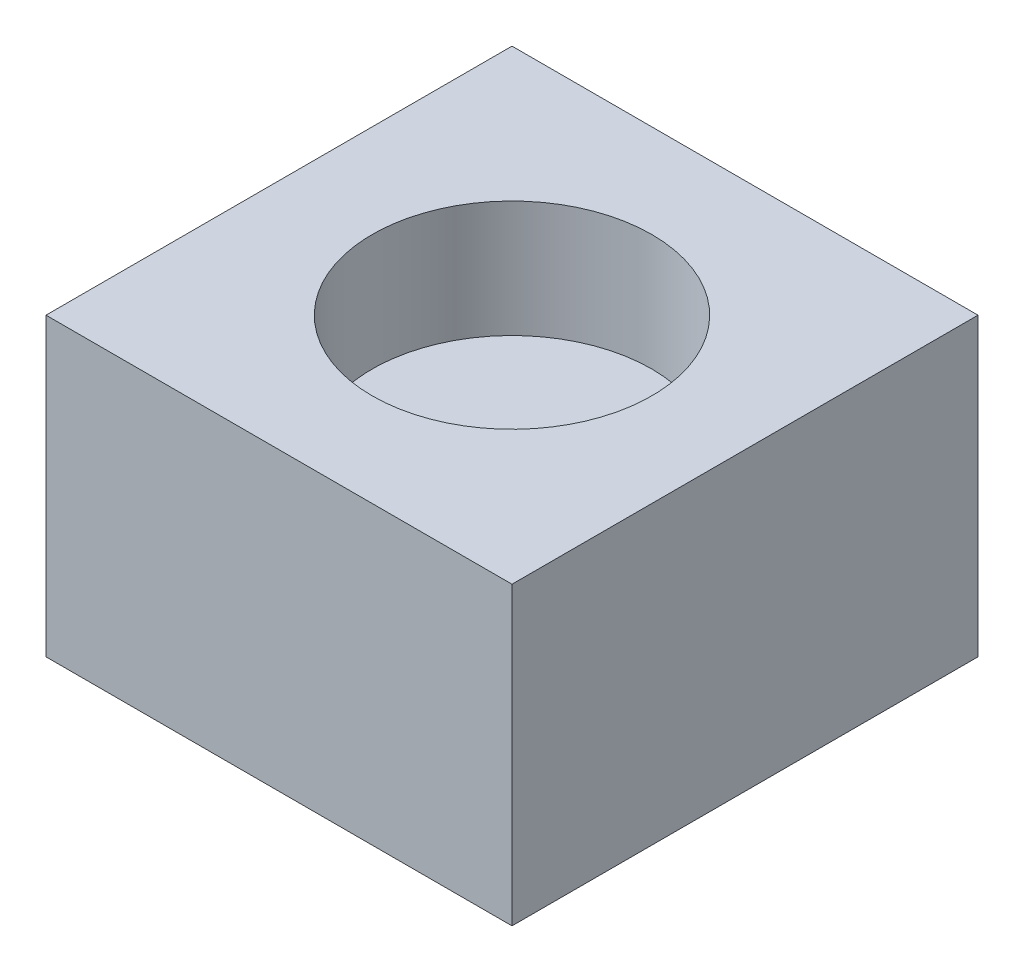
ISO-10303-21;
HEADER;
FILE_DESCRIPTION(('STEP AP214'),'2;1');
FILE_NAME('part.step','',(''),(''),'','','');
FILE_SCHEMA(('AUTOMOTIVE_DESIGN { 1 0 10303 214 1 1 1 1 }'));
ENDSEC;
DATA;
#1=APPLICATION_CONTEXT('core data for automotive mechanical design processes');
#2=APPLICATION_PROTOCOL_DEFINITION('international standard','automotive_design',2000,#1);
#3=PRODUCT_CONTEXT('',#1,'mechanical');
#4=PRODUCT('Part','Part','',(#3));
#5=PRODUCT_RELATED_PRODUCT_CATEGORY('part','',(#4));
#6=PRODUCT_DEFINITION_FORMATION('','',#4);
#7=PRODUCT_DEFINITION_CONTEXT('part definition',#1,'design');
#8=PRODUCT_DEFINITION('design','',#6,#7);
#9=PRODUCT_DEFINITION_SHAPE('','',#8);
#10=(LENGTH_UNIT() NAMED_UNIT(*) SI_UNIT(.MILLI.,.METRE.));
#11=(NAMED_UNIT(*) PLANE_ANGLE_UNIT() SI_UNIT($,.RADIAN.));
#12=(NAMED_UNIT(*) SI_UNIT($,.STERADIAN.) SOLID_ANGLE_UNIT());
#13=UNCERTAINTY_MEASURE_WITH_UNIT(LENGTH_MEASURE(1.E-05),#10,'distance_accuracy_value','');
#14=(GEOMETRIC_REPRESENTATION_CONTEXT(3) GLOBAL_UNCERTAINTY_ASSIGNED_CONTEXT((#13)) GLOBAL_UNIT_ASSIGNED_CONTEXT((#10,
#11,#12)) REPRESENTATION_CONTEXT('',''));
#15=CARTESIAN_POINT('',(0.,0.,0.));
#16=DIRECTION('',(0.,0.,1.));
#17=DIRECTION('',(1.,0.,0.));
#18=AXIS2_PLACEMENT_3D('',#15,#16,#17);
#19=CARTESIAN_POINT('',(0.,6.35,0.));
#20=DIRECTION('',(1.,0.,0.));
#21=DIRECTION('',(0.,0.,-1.));
#22=AXIS2_PLACEMENT_3D('',#19,#20,#21);
#23=PLANE('',#22);
#24=DIRECTION('',(0.,0.,1.));
#25=VECTOR('',#24,1.);
#26=CARTESIAN_POINT('',(0.,0.,0.));
#27=LINE('',#26,#25);
#28=CARTESIAN_POINT('',(0.,0.,-10.));
#29=VERTEX_POINT('',#28);
#30=CARTESIAN_POINT('',(0.,0.,0.));
#31=VERTEX_POINT('',#30);
#32=EDGE_CURVE('E113',#29,#31,#27,.T.);
#33=ORIENTED_EDGE('',*,*,#32,.T.);
#34=DIRECTION('',(0.,-1.,0.));
#35=VECTOR('',#34,1.);
#36=CARTESIAN_POINT('',(0.,6.35,0.));
#37=LINE('',#36,#35);
#38=CARTESIAN_POINT('',(0.,6.35,0.));
#39=VERTEX_POINT('',#38);
#40=EDGE_CURVE('E11',#39,#31,#37,.T.);
#41=ORIENTED_EDGE('',*,*,#40,.F.);
#42=DIRECTION('',(0.,0.,1.));
#43=VECTOR('',#42,1.);
#44=CARTESIAN_POINT('',(0.,6.35,0.));
#45=LINE('',#44,#43);
#46=CARTESIAN_POINT('',(0.,6.35,-10.));
#47=VERTEX_POINT('',#46);
#48=EDGE_CURVE('E97',#47,#39,#45,.T.);
#49=ORIENTED_EDGE('',*,*,#48,.F.);
#50=DIRECTION('',(0.,-1.,0.));
#51=VECTOR('',#50,1.);
#52=CARTESIAN_POINT('',(0.,6.35,-10.));
#53=LINE('',#52,#51);
#54=EDGE_CURVE('E109',#47,#29,#53,.T.);
#55=ORIENTED_EDGE('',*,*,#54,.T.);
#56=EDGE_LOOP('',(#33,#41,#49,#55));
#57=FACE_BOUND('',#56,.T.);
#58=ADVANCED_FACE('F45',(#57),#23,.F.);
#59=CARTESIAN_POINT('',(0.,6.35,0.));
#60=DIRECTION('',(0.,0.,-1.));
#61=DIRECTION('',(-1.,0.,0.));
#62=AXIS2_PLACEMENT_3D('',#59,#60,#61);
#63=PLANE('',#62);
#64=DIRECTION('',(1.,0.,0.));
#65=VECTOR('',#64,1.);
#66=CARTESIAN_POINT('',(0.,0.,0.));
#67=LINE('',#66,#65);
#68=CARTESIAN_POINT('',(10.,0.,0.));
#69=VERTEX_POINT('',#68);
#70=EDGE_CURVE('E102',#31,#69,#67,.T.);
#71=ORIENTED_EDGE('',*,*,#70,.T.);
#72=DIRECTION('',(0.,-1.,0.));
#73=VECTOR('',#72,1.);
#74=CARTESIAN_POINT('',(10.,6.35,0.));
#75=LINE('',#74,#73);
#76=CARTESIAN_POINT('',(10.,6.35,0.));
#77=VERTEX_POINT('',#76);
#78=EDGE_CURVE('E54',#77,#69,#75,.T.);
#79=ORIENTED_EDGE('',*,*,#78,.F.);
#80=DIRECTION('',(1.,0.,0.));
#81=VECTOR('',#80,1.);
#82=CARTESIAN_POINT('',(0.,6.35,0.));
#83=LINE('',#82,#81);
#84=EDGE_CURVE('E92',#39,#77,#83,.T.);
#85=ORIENTED_EDGE('',*,*,#84,.F.);
#86=ORIENTED_EDGE('',*,*,#40,.T.);
#87=EDGE_LOOP('',(#71,#79,#85,#86));
#88=FACE_BOUND('',#87,.T.);
#89=ADVANCED_FACE('F101',(#88),#63,.F.);
#90=CARTESIAN_POINT('',(10.,6.35,0.));
#91=DIRECTION('',(-1.,0.,0.));
#92=DIRECTION('',(0.,0.,1.));
#93=AXIS2_PLACEMENT_3D('',#90,#91,#92);
#94=PLANE('',#93);
#95=DIRECTION('',(0.,0.,-1.));
#96=VECTOR('',#95,1.);
#97=CARTESIAN_POINT('',(10.,0.,0.));
#98=LINE('',#97,#96);
#99=CARTESIAN_POINT('',(10.,0.,-10.));
#100=VERTEX_POINT('',#99);
#101=EDGE_CURVE('E79',#69,#100,#98,.T.);
#102=ORIENTED_EDGE('',*,*,#101,.T.);
#103=DIRECTION('',(0.,-1.,0.));
#104=VECTOR('',#103,1.);
#105=CARTESIAN_POINT('',(10.,6.35,-10.));
#106=LINE('',#105,#104);
#107=CARTESIAN_POINT('',(10.,6.35,-10.));
#108=VERTEX_POINT('',#107);
#109=EDGE_CURVE('E104',#108,#100,#106,.T.);
#110=ORIENTED_EDGE('',*,*,#109,.F.);
#111=DIRECTION('',(0.,0.,-1.));
#112=VECTOR('',#111,1.);
#113=CARTESIAN_POINT('',(10.,6.35,0.));
#114=LINE('',#113,#112);
#115=EDGE_CURVE('E95',#77,#108,#114,.T.);
#116=ORIENTED_EDGE('',*,*,#115,.F.);
#117=ORIENTED_EDGE('',*,*,#78,.T.);
#118=EDGE_LOOP('',(#102,#110,#116,#117));
#119=FACE_BOUND('',#118,.T.);
#120=ADVANCED_FACE('F105',(#119),#94,.F.);
#121=CARTESIAN_POINT('',(0.,6.35,-10.));
#122=DIRECTION('',(0.,0.,1.));
#123=DIRECTION('',(1.,0.,0.));
#124=AXIS2_PLACEMENT_3D('',#121,#122,#123);
#125=PLANE('',#124);
#126=DIRECTION('',(-1.,0.,0.));
#127=VECTOR('',#126,1.);
#128=CARTESIAN_POINT('',(0.,0.,-10.));
#129=LINE('',#128,#127);
#130=EDGE_CURVE('E85',#100,#29,#129,.T.);
#131=ORIENTED_EDGE('',*,*,#130,.T.);
#132=ORIENTED_EDGE('',*,*,#54,.F.);
#133=DIRECTION('',(-1.,0.,0.));
#134=VECTOR('',#133,1.);
#135=CARTESIAN_POINT('',(0.,6.35,-10.));
#136=LINE('',#135,#134);
#137=EDGE_CURVE('E62',#108,#47,#136,.T.);
#138=ORIENTED_EDGE('',*,*,#137,.F.);
#139=ORIENTED_EDGE('',*,*,#109,.T.);
#140=EDGE_LOOP('',(#131,#132,#138,#139));
#141=FACE_BOUND('',#140,.T.);
#142=ADVANCED_FACE('F127',(#141),#125,.F.);
#143=CARTESIAN_POINT('',(0.,6.35,0.));
#144=DIRECTION('',(0.,-1.,0.));
#145=DIRECTION('',(0.,0.,-1.));
#146=AXIS2_PLACEMENT_3D('',#143,#144,#145);
#147=PLANE('',#146);
#148=CARTESIAN_POINT('',(5.,6.35,-5.));
#149=DIRECTION('',(0.,1.,0.));
#150=DIRECTION('',(0.,0.,1.));
#151=AXIS2_PLACEMENT_3D('',#148,#149,#150);
#152=CIRCLE('',#151,3.);
#153=CARTESIAN_POINT('',(5.,6.35,-2.));
#154=VERTEX_POINT('',#153);
#155=EDGE_CURVE('E134',#154,#154,#152,.T.);
#156=ORIENTED_EDGE('',*,*,#155,.F.);
#157=EDGE_LOOP('',(#156));
#158=FACE_BOUND('',#157,.T.);
#159=ORIENTED_EDGE('',*,*,#48,.T.);
#160=ORIENTED_EDGE('',*,*,#84,.T.);
#161=ORIENTED_EDGE('',*,*,#115,.T.);
#162=ORIENTED_EDGE('',*,*,#137,.T.);
#163=EDGE_LOOP('',(#159,#160,#161,#162));
#164=FACE_BOUND('',#163,.T.);
#165=ADVANCED_FACE('F93',(#158,#164),#147,.F.);
#166=CARTESIAN_POINT('',(0.,0.,0.));
#167=DIRECTION('',(0.,-1.,0.));
#168=DIRECTION('',(0.,0.,-1.));
#169=AXIS2_PLACEMENT_3D('',#166,#167,#168);
#170=PLANE('',#169);
#171=ORIENTED_EDGE('',*,*,#32,.F.);
#172=ORIENTED_EDGE('',*,*,#130,.F.);
#173=ORIENTED_EDGE('',*,*,#101,.F.);
#174=ORIENTED_EDGE('',*,*,#70,.F.);
#175=EDGE_LOOP('',(#171,#172,#173,#174));
#176=FACE_BOUND('',#175,.T.);
#177=ADVANCED_FACE('F130',(#176),#170,.T.);
#178=CARTESIAN_POINT('',(5.,3.85,-5.));
#179=DIRECTION('',(0.,1.,0.));
#180=DIRECTION('',(0.,0.,1.));
#181=AXIS2_PLACEMENT_3D('',#178,#179,#180);
#182=CYLINDRICAL_SURFACE('',#181,3.);
#183=CARTESIAN_POINT('',(5.,3.85,-5.));
#184=DIRECTION('',(0.,1.,0.));
#185=DIRECTION('',(0.,0.,1.));
#186=AXIS2_PLACEMENT_3D('',#183,#184,#185);
#187=CIRCLE('',#186,3.);
#188=CARTESIAN_POINT('',(5.,3.85,-2.));
#189=VERTEX_POINT('',#188);
#190=EDGE_CURVE('E117',#189,#189,#187,.T.);
#191=ORIENTED_EDGE('',*,*,#190,.F.);
#192=EDGE_LOOP('',(#191));
#193=FACE_BOUND('',#192,.T.);
#194=ORIENTED_EDGE('',*,*,#155,.T.);
#195=EDGE_LOOP('',(#194));
#196=FACE_BOUND('',#195,.T.);
#197=ADVANCED_FACE('F144',(#193,#196),#182,.F.);
#198=CARTESIAN_POINT('',(5.,3.85,-5.));
#199=DIRECTION('',(0.,1.,0.));
#200=DIRECTION('',(0.,0.,1.));
#201=AXIS2_PLACEMENT_3D('',#198,#199,#200);
#202=PLANE('',#201);
#203=ORIENTED_EDGE('',*,*,#190,.T.);
#204=EDGE_LOOP('',(#203));
#205=FACE_BOUND('',#204,.T.);
#206=ADVANCED_FACE('F142',(#205),#202,.T.);
#207=CLOSED_SHELL('',(#58,#89,#120,#142,#165,#177,#197,#206));
#208=MANIFOLD_SOLID_BREP('B2',#207);
#209=ADVANCED_BREP_SHAPE_REPRESENTATION('',(#18,#208),#14);
#210=SHAPE_DEFINITION_REPRESENTATION(#9,#209);
ENDSEC;
END-ISO-10303-21;
